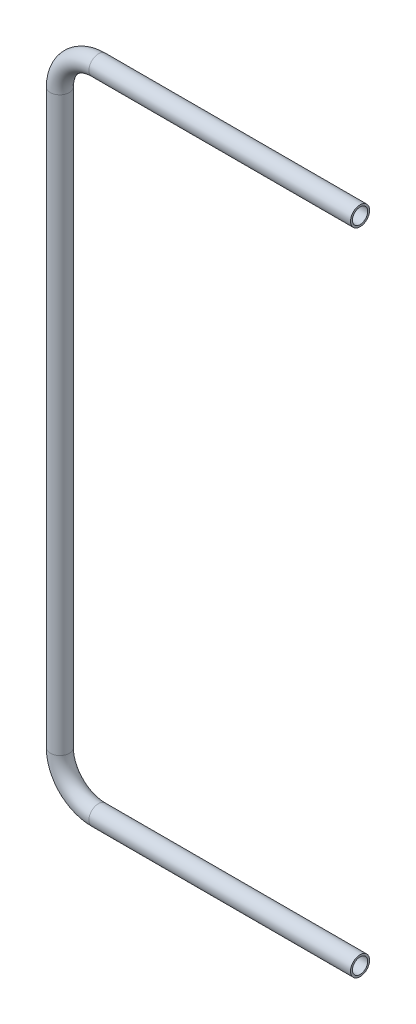
ISO-10303-21;
HEADER;
FILE_DESCRIPTION(('STEP AP214'),'2;1');
FILE_NAME('part.step','',(''),(''),'','','');
FILE_SCHEMA(('AUTOMOTIVE_DESIGN { 1 0 10303 214 1 1 1 1 }'));
ENDSEC;
DATA;
#1=APPLICATION_CONTEXT('core data for automotive mechanical design processes');
#2=APPLICATION_PROTOCOL_DEFINITION('international standard','automotive_design',2000,#1);
#3=PRODUCT_CONTEXT('',#1,'mechanical');
#4=PRODUCT('Part','Part','',(#3));
#5=PRODUCT_RELATED_PRODUCT_CATEGORY('part','',(#4));
#6=PRODUCT_DEFINITION_FORMATION('','',#4);
#7=PRODUCT_DEFINITION_CONTEXT('part definition',#1,'design');
#8=PRODUCT_DEFINITION('design','',#6,#7);
#9=PRODUCT_DEFINITION_SHAPE('','',#8);
#10=(LENGTH_UNIT() NAMED_UNIT(*) SI_UNIT(.MILLI.,.METRE.));
#11=(NAMED_UNIT(*) PLANE_ANGLE_UNIT() SI_UNIT($,.RADIAN.));
#12=(NAMED_UNIT(*) SI_UNIT($,.STERADIAN.) SOLID_ANGLE_UNIT());
#13=UNCERTAINTY_MEASURE_WITH_UNIT(LENGTH_MEASURE(1.E-05),#10,'distance_accuracy_value','');
#14=(GEOMETRIC_REPRESENTATION_CONTEXT(3) GLOBAL_UNCERTAINTY_ASSIGNED_CONTEXT((#13)) GLOBAL_UNIT_ASSIGNED_CONTEXT((#10,
#11,#12)) REPRESENTATION_CONTEXT('',''));
#15=CARTESIAN_POINT('',(0.,0.,0.));
#16=DIRECTION('',(0.,0.,1.));
#17=DIRECTION('',(1.,0.,0.));
#18=AXIS2_PLACEMENT_3D('',#15,#16,#17);
#19=CARTESIAN_POINT('',(0.,0.,0.));
#20=DIRECTION('',(-1.,0.,0.));
#21=DIRECTION('',(0.,-1.,0.));
#22=AXIS2_PLACEMENT_3D('',#19,#20,#21);
#23=CYLINDRICAL_SURFACE('',#22,16.7005);
#24=CARTESIAN_POINT('',(-457.2,0.,0.));
#25=DIRECTION('',(1.,0.,0.));
#26=DIRECTION('',(0.,0.,-1.));
#27=AXIS2_PLACEMENT_3D('',#24,#25,#26);
#28=CIRCLE('',#27,16.7005);
#29=CARTESIAN_POINT('',(-457.2,-16.7005000000001,0.));
#30=VERTEX_POINT('',#29);
#31=EDGE_CURVE('E115',#30,#30,#28,.T.);
#32=ORIENTED_EDGE('',*,*,#31,.T.);
#33=EDGE_LOOP('',(#32));
#34=FACE_BOUND('',#33,.T.);
#35=CARTESIAN_POINT('',(0.,0.,0.));
#36=DIRECTION('',(1.,0.,0.));
#37=DIRECTION('',(0.,0.,-1.));
#38=AXIS2_PLACEMENT_3D('',#35,#36,#37);
#39=CIRCLE('',#38,16.7005);
#40=CARTESIAN_POINT('',(0.,0.,-16.7005));
#41=VERTEX_POINT('',#40);
#42=EDGE_CURVE('E49',#41,#41,#39,.T.);
#43=ORIENTED_EDGE('',*,*,#42,.F.);
#44=EDGE_LOOP('',(#43));
#45=FACE_BOUND('',#44,.T.);
#46=ADVANCED_FACE('F34',(#34,#45),#23,.T.);
#47=CARTESIAN_POINT('',(-457.2,67.5004999999999,0.));
#48=DIRECTION('',(0.,0.,-1.));
#49=DIRECTION('',(-1.,0.,0.));
#50=AXIS2_PLACEMENT_3D('',#47,#48,#49);
#51=TOROIDAL_SURFACE('',#50,67.5005,16.7005);
#52=CARTESIAN_POINT('',(-524.7005,67.5004999999999,0.));
#53=DIRECTION('',(0.,-1.,0.));
#54=DIRECTION('',(0.,0.,-1.));
#55=AXIS2_PLACEMENT_3D('',#52,#53,#54);
#56=CIRCLE('',#55,16.7005);
#57=CARTESIAN_POINT('',(-541.401,67.5004999999999,0.));
#58=VERTEX_POINT('',#57);
#59=EDGE_CURVE('E118',#58,#58,#56,.T.);
#60=CARTESIAN_POINT('',(-457.2,67.5004999999999,0.));
#61=DIRECTION('',(0.,0.,-1.));
#62=DIRECTION('',(-1.,0.,0.));
#63=AXIS2_PLACEMENT_3D('',#60,#61,#62);
#64=CIRCLE('',#63,84.201);
#65=EDGE_CURVE('',#30,#58,#64,.T.);
#66=ORIENTED_EDGE('',*,*,#31,.F.);
#67=ORIENTED_EDGE('',*,*,#59,.T.);
#68=ORIENTED_EDGE('',*,*,#65,.T.);
#69=ORIENTED_EDGE('',*,*,#65,.F.);
#70=EDGE_LOOP('',(#66,#68,#67,#69));
#71=FACE_BOUND('',#70,.T.);
#72=ADVANCED_FACE('F139',(#71),#51,.T.);
#73=CARTESIAN_POINT('',(-524.7005,67.5004999999999,0.));
#74=DIRECTION('',(0.,1.,0.));
#75=DIRECTION('',(-1.,0.,0.));
#76=AXIS2_PLACEMENT_3D('',#73,#74,#75);
#77=CYLINDRICAL_SURFACE('',#76,16.7005);
#78=CARTESIAN_POINT('',(-524.7005,1067.562,0.));
#79=DIRECTION('',(0.,-1.,0.));
#80=DIRECTION('',(0.,0.,-1.));
#81=AXIS2_PLACEMENT_3D('',#78,#79,#80);
#82=CIRCLE('',#81,16.7005);
#83=CARTESIAN_POINT('',(-541.401,1067.562,0.));
#84=VERTEX_POINT('',#83);
#85=EDGE_CURVE('E120',#84,#84,#82,.T.);
#86=ORIENTED_EDGE('',*,*,#85,.T.);
#87=EDGE_LOOP('',(#86));
#88=FACE_BOUND('',#87,.T.);
#89=ORIENTED_EDGE('',*,*,#59,.F.);
#90=EDGE_LOOP('',(#89));
#91=FACE_BOUND('',#90,.T.);
#92=ADVANCED_FACE('F135',(#88,#91),#77,.T.);
#93=CARTESIAN_POINT('',(-457.2,1067.562,0.));
#94=DIRECTION('',(0.,0.,-1.));
#95=DIRECTION('',(-1.,0.,0.));
#96=AXIS2_PLACEMENT_3D('',#93,#94,#95);
#97=TOROIDAL_SURFACE('',#96,67.5005,16.7005);
#98=CARTESIAN_POINT('',(-457.2,1135.0625,0.));
#99=DIRECTION('',(-1.,0.,0.));
#100=DIRECTION('',(0.,0.,-1.));
#101=AXIS2_PLACEMENT_3D('',#98,#99,#100);
#102=CIRCLE('',#101,16.7005);
#103=CARTESIAN_POINT('',(-457.2,1151.763,0.));
#104=VERTEX_POINT('',#103);
#105=EDGE_CURVE('E38',#104,#104,#102,.T.);
#106=CARTESIAN_POINT('',(-457.2,1067.562,0.));
#107=DIRECTION('',(0.,0.,-1.));
#108=DIRECTION('',(-1.,0.,0.));
#109=AXIS2_PLACEMENT_3D('',#106,#107,#108);
#110=CIRCLE('',#109,84.201);
#111=EDGE_CURVE('',#84,#104,#110,.T.);
#112=ORIENTED_EDGE('',*,*,#85,.F.);
#113=ORIENTED_EDGE('',*,*,#105,.T.);
#114=ORIENTED_EDGE('',*,*,#111,.T.);
#115=ORIENTED_EDGE('',*,*,#111,.F.);
#116=EDGE_LOOP('',(#112,#114,#113,#115));
#117=FACE_BOUND('',#116,.T.);
#118=ADVANCED_FACE('F127',(#117),#97,.T.);
#119=CARTESIAN_POINT('',(-457.2,1135.0625,0.));
#120=DIRECTION('',(1.,0.,0.));
#121=DIRECTION('',(0.,1.,0.));
#122=AXIS2_PLACEMENT_3D('',#119,#120,#121);
#123=CYLINDRICAL_SURFACE('',#122,16.7005);
#124=CARTESIAN_POINT('',(-3.33066907387547E-13,1135.0625,0.));
#125=DIRECTION('',(-1.,0.,0.));
#126=DIRECTION('',(0.,0.,-1.));
#127=AXIS2_PLACEMENT_3D('',#124,#125,#126);
#128=CIRCLE('',#127,16.7005);
#129=CARTESIAN_POINT('',(-3.33066907387547E-13,1135.0625,-16.7005));
#130=VERTEX_POINT('',#129);
#131=EDGE_CURVE('E54',#130,#130,#128,.T.);
#132=ORIENTED_EDGE('',*,*,#131,.T.);
#133=EDGE_LOOP('',(#132));
#134=FACE_BOUND('',#133,.T.);
#135=ORIENTED_EDGE('',*,*,#105,.F.);
#136=EDGE_LOOP('',(#135));
#137=FACE_BOUND('',#136,.T.);
#138=ADVANCED_FACE('F36',(#134,#137),#123,.T.);
#139=CARTESIAN_POINT('',(0.,0.,0.));
#140=DIRECTION('',(1.,0.,0.));
#141=DIRECTION('',(0.,0.,-1.));
#142=AXIS2_PLACEMENT_3D('',#139,#140,#141);
#143=PLANE('',#142);
#144=CARTESIAN_POINT('',(0.,0.,0.));
#145=DIRECTION('',(1.,0.,0.));
#146=DIRECTION('',(0.,0.,-1.));
#147=AXIS2_PLACEMENT_3D('',#144,#145,#146);
#148=CIRCLE('',#147,13.335);
#149=CARTESIAN_POINT('',(0.,0.,-13.335));
#150=VERTEX_POINT('',#149);
#151=EDGE_CURVE('E102',#150,#150,#148,.F.);
#152=ORIENTED_EDGE('',*,*,#151,.T.);
#153=EDGE_LOOP('',(#152));
#154=FACE_BOUND('',#153,.T.);
#155=ORIENTED_EDGE('',*,*,#42,.T.);
#156=EDGE_LOOP('',(#155));
#157=FACE_BOUND('',#156,.T.);
#158=ADVANCED_FACE('F67',(#154,#157),#143,.T.);
#159=CARTESIAN_POINT('',(-3.33066907387547E-13,1135.0625,0.));
#160=DIRECTION('',(-1.,0.,0.));
#161=DIRECTION('',(0.,0.,-1.));
#162=AXIS2_PLACEMENT_3D('',#159,#160,#161);
#163=PLANE('',#162);
#164=CARTESIAN_POINT('',(-3.33066907387547E-13,1135.0625,0.));
#165=DIRECTION('',(-1.,0.,0.));
#166=DIRECTION('',(0.,0.,-1.));
#167=AXIS2_PLACEMENT_3D('',#164,#165,#166);
#168=CIRCLE('',#167,13.335);
#169=CARTESIAN_POINT('',(-3.33066907387547E-13,1135.0625,-13.335));
#170=VERTEX_POINT('',#169);
#171=EDGE_CURVE('E11',#170,#170,#168,.F.);
#172=ORIENTED_EDGE('',*,*,#171,.F.);
#173=EDGE_LOOP('',(#172));
#174=FACE_BOUND('',#173,.T.);
#175=ORIENTED_EDGE('',*,*,#131,.F.);
#176=EDGE_LOOP('',(#175));
#177=FACE_BOUND('',#176,.T.);
#178=ADVANCED_FACE('F64',(#174,#177),#163,.F.);
#179=CARTESIAN_POINT('',(0.,0.,0.));
#180=DIRECTION('',(-1.,0.,0.));
#181=DIRECTION('',(0.,-1.,0.));
#182=AXIS2_PLACEMENT_3D('',#179,#180,#181);
#183=CYLINDRICAL_SURFACE('',#182,13.335);
#184=CARTESIAN_POINT('',(-457.2,0.,0.));
#185=DIRECTION('',(1.,0.,0.));
#186=DIRECTION('',(0.,0.,-1.));
#187=AXIS2_PLACEMENT_3D('',#184,#185,#186);
#188=CIRCLE('',#187,13.335);
#189=CARTESIAN_POINT('',(-457.2,-13.3350000000001,0.));
#190=VERTEX_POINT('',#189);
#191=EDGE_CURVE('E101',#190,#190,#188,.F.);
#192=ORIENTED_EDGE('',*,*,#191,.T.);
#193=EDGE_LOOP('',(#192));
#194=FACE_BOUND('',#193,.T.);
#195=ORIENTED_EDGE('',*,*,#151,.F.);
#196=EDGE_LOOP('',(#195));
#197=FACE_BOUND('',#196,.T.);
#198=ADVANCED_FACE('F66',(#194,#197),#183,.F.);
#199=CARTESIAN_POINT('',(-457.2,67.5004999999999,0.));
#200=DIRECTION('',(0.,0.,-1.));
#201=DIRECTION('',(-1.,0.,0.));
#202=AXIS2_PLACEMENT_3D('',#199,#200,#201);
#203=TOROIDAL_SURFACE('',#202,67.5005,13.335);
#204=CARTESIAN_POINT('',(-524.7005,67.5004999999999,0.));
#205=DIRECTION('',(0.,-1.,0.));
#206=DIRECTION('',(0.,0.,-1.));
#207=AXIS2_PLACEMENT_3D('',#204,#205,#206);
#208=CIRCLE('',#207,13.335);
#209=CARTESIAN_POINT('',(-538.0355,67.5004999999999,0.));
#210=VERTEX_POINT('',#209);
#211=EDGE_CURVE('E98',#210,#210,#208,.F.);
#212=CARTESIAN_POINT('',(-457.2,67.5004999999999,0.));
#213=DIRECTION('',(0.,0.,-1.));
#214=DIRECTION('',(-1.,0.,0.));
#215=AXIS2_PLACEMENT_3D('',#212,#213,#214);
#216=CIRCLE('',#215,80.8355);
#217=EDGE_CURVE('',#190,#210,#216,.T.);
#218=ORIENTED_EDGE('',*,*,#191,.F.);
#219=ORIENTED_EDGE('',*,*,#211,.T.);
#220=ORIENTED_EDGE('',*,*,#217,.T.);
#221=ORIENTED_EDGE('',*,*,#217,.F.);
#222=EDGE_LOOP('',(#218,#220,#219,#221));
#223=FACE_BOUND('',#222,.T.);
#224=ADVANCED_FACE('F73',(#223),#203,.F.);
#225=CARTESIAN_POINT('',(-524.7005,67.5004999999999,0.));
#226=DIRECTION('',(0.,1.,0.));
#227=DIRECTION('',(-1.,0.,0.));
#228=AXIS2_PLACEMENT_3D('',#225,#226,#227);
#229=CYLINDRICAL_SURFACE('',#228,13.335);
#230=CARTESIAN_POINT('',(-524.7005,1067.562,0.));
#231=DIRECTION('',(0.,-1.,0.));
#232=DIRECTION('',(0.,0.,-1.));
#233=AXIS2_PLACEMENT_3D('',#230,#231,#232);
#234=CIRCLE('',#233,13.335);
#235=CARTESIAN_POINT('',(-538.0355,1067.562,0.));
#236=VERTEX_POINT('',#235);
#237=EDGE_CURVE('E104',#236,#236,#234,.F.);
#238=ORIENTED_EDGE('',*,*,#237,.T.);
#239=EDGE_LOOP('',(#238));
#240=FACE_BOUND('',#239,.T.);
#241=ORIENTED_EDGE('',*,*,#211,.F.);
#242=EDGE_LOOP('',(#241));
#243=FACE_BOUND('',#242,.T.);
#244=ADVANCED_FACE('F84',(#240,#243),#229,.F.);
#245=CARTESIAN_POINT('',(-457.2,1067.562,0.));
#246=DIRECTION('',(0.,0.,-1.));
#247=DIRECTION('',(-1.,0.,0.));
#248=AXIS2_PLACEMENT_3D('',#245,#246,#247);
#249=TOROIDAL_SURFACE('',#248,67.5005,13.335);
#250=CARTESIAN_POINT('',(-457.2,1135.0625,0.));
#251=DIRECTION('',(-1.,0.,0.));
#252=DIRECTION('',(0.,0.,-1.));
#253=AXIS2_PLACEMENT_3D('',#250,#251,#252);
#254=CIRCLE('',#253,13.335);
#255=CARTESIAN_POINT('',(-457.2,1148.3975,0.));
#256=VERTEX_POINT('',#255);
#257=EDGE_CURVE('E43',#256,#256,#254,.F.);
#258=CARTESIAN_POINT('',(-457.2,1067.562,0.));
#259=DIRECTION('',(0.,0.,-1.));
#260=DIRECTION('',(-1.,0.,0.));
#261=AXIS2_PLACEMENT_3D('',#258,#259,#260);
#262=CIRCLE('',#261,80.8355);
#263=EDGE_CURVE('',#236,#256,#262,.T.);
#264=ORIENTED_EDGE('',*,*,#237,.F.);
#265=ORIENTED_EDGE('',*,*,#257,.T.);
#266=ORIENTED_EDGE('',*,*,#263,.T.);
#267=ORIENTED_EDGE('',*,*,#263,.F.);
#268=EDGE_LOOP('',(#264,#266,#265,#267));
#269=FACE_BOUND('',#268,.T.);
#270=ADVANCED_FACE('F80',(#269),#249,.F.);
#271=CARTESIAN_POINT('',(-457.2,1135.0625,0.));
#272=DIRECTION('',(1.,0.,0.));
#273=DIRECTION('',(0.,1.,0.));
#274=AXIS2_PLACEMENT_3D('',#271,#272,#273);
#275=CYLINDRICAL_SURFACE('',#274,13.335);
#276=ORIENTED_EDGE('',*,*,#171,.T.);
#277=EDGE_LOOP('',(#276));
#278=FACE_BOUND('',#277,.T.);
#279=ORIENTED_EDGE('',*,*,#257,.F.);
#280=EDGE_LOOP('',(#279));
#281=FACE_BOUND('',#280,.T.);
#282=ADVANCED_FACE('F61',(#278,#281),#275,.F.);
#283=CLOSED_SHELL('',(#46,#72,#92,#118,#138,#158,#178,#198,#224,#244,#270,#282));
#284=MANIFOLD_SOLID_BREP('B2',#283);
#285=ADVANCED_BREP_SHAPE_REPRESENTATION('',(#18,#284),#14);
#286=SHAPE_DEFINITION_REPRESENTATION(#9,#285);
ENDSEC;
END-ISO-10303-21;
